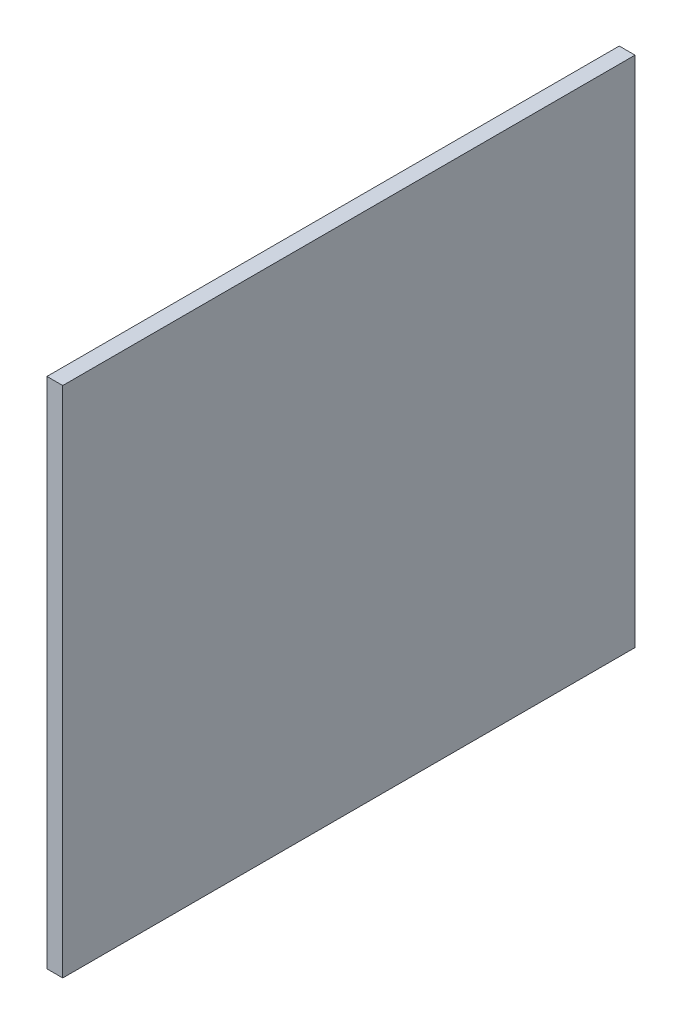
ISO-10303-21;
HEADER;
FILE_DESCRIPTION(('STEP AP214'),'2;1');
FILE_NAME('part.step','',(''),(''),'','','');
FILE_SCHEMA(('AUTOMOTIVE_DESIGN { 1 0 10303 214 1 1 1 1 }'));
ENDSEC;
DATA;
#1=APPLICATION_CONTEXT('core data for automotive mechanical design processes');
#2=APPLICATION_PROTOCOL_DEFINITION('international standard','automotive_design',2000,#1);
#3=PRODUCT_CONTEXT('',#1,'mechanical');
#4=PRODUCT('Part','Part','',(#3));
#5=PRODUCT_RELATED_PRODUCT_CATEGORY('part','',(#4));
#6=PRODUCT_DEFINITION_FORMATION('','',#4);
#7=PRODUCT_DEFINITION_CONTEXT('part definition',#1,'design');
#8=PRODUCT_DEFINITION('design','',#6,#7);
#9=PRODUCT_DEFINITION_SHAPE('','',#8);
#10=(LENGTH_UNIT() NAMED_UNIT(*) SI_UNIT(.MILLI.,.METRE.));
#11=(NAMED_UNIT(*) PLANE_ANGLE_UNIT() SI_UNIT($,.RADIAN.));
#12=(NAMED_UNIT(*) SI_UNIT($,.STERADIAN.) SOLID_ANGLE_UNIT());
#13=UNCERTAINTY_MEASURE_WITH_UNIT(LENGTH_MEASURE(1.E-05),#10,'distance_accuracy_value','');
#14=(GEOMETRIC_REPRESENTATION_CONTEXT(3) GLOBAL_UNCERTAINTY_ASSIGNED_CONTEXT((#13)) GLOBAL_UNIT_ASSIGNED_CONTEXT((#10,
#11,#12)) REPRESENTATION_CONTEXT('',''));
#15=CARTESIAN_POINT('',(0.,0.,0.));
#16=DIRECTION('',(0.,0.,1.));
#17=DIRECTION('',(1.,0.,0.));
#18=AXIS2_PLACEMENT_3D('',#15,#16,#17);
#19=CARTESIAN_POINT('',(-20.439998,-21.1500000000002,86.995008));
#20=DIRECTION('',(-1.,0.,0.));
#21=DIRECTION('',(0.,0.,1.));
#22=AXIS2_PLACEMENT_3D('',#19,#20,#21);
#23=PLANE('',#22);
#24=DIRECTION('',(0.,1.,0.));
#25=VECTOR('',#24,1.);
#26=CARTESIAN_POINT('',(-20.439998,-21.1500000000002,115.995008));
#27=LINE('',#26,#25);
#28=CARTESIAN_POINT('',(-20.439998,-21.1500000000002,115.995008));
#29=VERTEX_POINT('',#28);
#30=CARTESIAN_POINT('',(-20.439998,4.84999999999987,115.995008));
#31=VERTEX_POINT('',#30);
#32=EDGE_CURVE('E11',#29,#31,#27,.T.);
#33=ORIENTED_EDGE('',*,*,#32,.T.);
#34=DIRECTION('',(0.,0.,-1.));
#35=VECTOR('',#34,1.);
#36=CARTESIAN_POINT('',(-20.439998,4.84999999999987,86.995008));
#37=LINE('',#36,#35);
#38=CARTESIAN_POINT('',(-20.439998,4.84999999999987,86.995008));
#39=VERTEX_POINT('',#38);
#40=EDGE_CURVE('E27',#31,#39,#37,.T.);
#41=ORIENTED_EDGE('',*,*,#40,.T.);
#42=DIRECTION('',(0.,-1.,0.));
#43=VECTOR('',#42,1.);
#44=CARTESIAN_POINT('',(-20.439998,-21.1500000000002,86.995008));
#45=LINE('',#44,#43);
#46=CARTESIAN_POINT('',(-20.439998,-21.1500000000002,86.995008));
#47=VERTEX_POINT('',#46);
#48=EDGE_CURVE('E79',#39,#47,#45,.T.);
#49=ORIENTED_EDGE('',*,*,#48,.T.);
#50=DIRECTION('',(0.,0.,1.));
#51=VECTOR('',#50,1.);
#52=CARTESIAN_POINT('',(-20.439998,-21.1500000000002,86.995008));
#53=LINE('',#52,#51);
#54=EDGE_CURVE('E81',#47,#29,#53,.T.);
#55=ORIENTED_EDGE('',*,*,#54,.T.);
#56=EDGE_LOOP('',(#33,#41,#49,#55));
#57=FACE_BOUND('',#56,.T.);
#58=ADVANCED_FACE('F17',(#57),#23,.T.);
#59=CARTESIAN_POINT('',(-20.439998,4.84999999999987,115.995008));
#60=DIRECTION('',(0.,1.,0.));
#61=DIRECTION('',(0.,0.,1.));
#62=AXIS2_PLACEMENT_3D('',#59,#60,#61);
#63=PLANE('',#62);
#64=DIRECTION('',(1.,0.,0.));
#65=VECTOR('',#64,1.);
#66=CARTESIAN_POINT('',(-20.439998,4.84999999999987,86.995008));
#67=LINE('',#66,#65);
#68=CARTESIAN_POINT('',(-19.639998,4.84999999999987,86.995008));
#69=VERTEX_POINT('',#68);
#70=EDGE_CURVE('E76',#39,#69,#67,.T.);
#71=ORIENTED_EDGE('',*,*,#70,.F.);
#72=ORIENTED_EDGE('',*,*,#40,.F.);
#73=DIRECTION('',(-1.,0.,0.));
#74=VECTOR('',#73,1.);
#75=CARTESIAN_POINT('',(-20.439998,4.84999999999987,115.995008));
#76=LINE('',#75,#74);
#77=CARTESIAN_POINT('',(-19.639998,4.84999999999987,115.995008));
#78=VERTEX_POINT('',#77);
#79=EDGE_CURVE('E35',#78,#31,#76,.T.);
#80=ORIENTED_EDGE('',*,*,#79,.F.);
#81=DIRECTION('',(0.,0.,1.));
#82=VECTOR('',#81,1.);
#83=CARTESIAN_POINT('',(-19.639998,4.84999999999987,115.995008));
#84=LINE('',#83,#82);
#85=EDGE_CURVE('E59',#69,#78,#84,.T.);
#86=ORIENTED_EDGE('',*,*,#85,.F.);
#87=EDGE_LOOP('',(#71,#72,#80,#86));
#88=FACE_BOUND('',#87,.T.);
#89=ADVANCED_FACE('F91',(#88),#63,.T.);
#90=CARTESIAN_POINT('',(-20.439998,-21.1500000000002,115.995008));
#91=DIRECTION('',(0.,0.,1.));
#92=DIRECTION('',(1.,0.,0.));
#93=AXIS2_PLACEMENT_3D('',#90,#91,#92);
#94=PLANE('',#93);
#95=ORIENTED_EDGE('',*,*,#79,.T.);
#96=ORIENTED_EDGE('',*,*,#32,.F.);
#97=DIRECTION('',(-1.,0.,0.));
#98=VECTOR('',#97,1.);
#99=CARTESIAN_POINT('',(-20.439998,-21.1500000000002,115.995008));
#100=LINE('',#99,#98);
#101=CARTESIAN_POINT('',(-19.639998,-21.1500000000002,115.995008));
#102=VERTEX_POINT('',#101);
#103=EDGE_CURVE('E62',#102,#29,#100,.T.);
#104=ORIENTED_EDGE('',*,*,#103,.F.);
#105=DIRECTION('',(0.,-1.,0.));
#106=VECTOR('',#105,1.);
#107=CARTESIAN_POINT('',(-19.639998,-21.1500000000002,115.995008));
#108=LINE('',#107,#106);
#109=EDGE_CURVE('E55',#78,#102,#108,.T.);
#110=ORIENTED_EDGE('',*,*,#109,.F.);
#111=EDGE_LOOP('',(#95,#96,#104,#110));
#112=FACE_BOUND('',#111,.T.);
#113=ADVANCED_FACE('F63',(#112),#94,.T.);
#114=CARTESIAN_POINT('',(-20.439998,-21.1500000000002,86.995008));
#115=DIRECTION('',(0.,-1.,0.));
#116=DIRECTION('',(0.,0.,-1.));
#117=AXIS2_PLACEMENT_3D('',#114,#115,#116);
#118=PLANE('',#117);
#119=ORIENTED_EDGE('',*,*,#103,.T.);
#120=ORIENTED_EDGE('',*,*,#54,.F.);
#121=DIRECTION('',(-1.,0.,0.));
#122=VECTOR('',#121,1.);
#123=CARTESIAN_POINT('',(-20.439998,-21.1500000000002,86.995008));
#124=LINE('',#123,#122);
#125=CARTESIAN_POINT('',(-19.639998,-21.1500000000002,86.995008));
#126=VERTEX_POINT('',#125);
#127=EDGE_CURVE('E67',#126,#47,#124,.T.);
#128=ORIENTED_EDGE('',*,*,#127,.F.);
#129=DIRECTION('',(0.,0.,-1.));
#130=VECTOR('',#129,1.);
#131=CARTESIAN_POINT('',(-19.639998,-21.1500000000002,86.995008));
#132=LINE('',#131,#130);
#133=EDGE_CURVE('E21',#102,#126,#132,.T.);
#134=ORIENTED_EDGE('',*,*,#133,.F.);
#135=EDGE_LOOP('',(#119,#120,#128,#134));
#136=FACE_BOUND('',#135,.T.);
#137=ADVANCED_FACE('F70',(#136),#118,.T.);
#138=CARTESIAN_POINT('',(-20.439998,4.84999999999987,86.995008));
#139=DIRECTION('',(0.,0.,-1.));
#140=DIRECTION('',(-1.,0.,0.));
#141=AXIS2_PLACEMENT_3D('',#138,#139,#140);
#142=PLANE('',#141);
#143=ORIENTED_EDGE('',*,*,#127,.T.);
#144=ORIENTED_EDGE('',*,*,#48,.F.);
#145=ORIENTED_EDGE('',*,*,#70,.T.);
#146=DIRECTION('',(0.,1.,0.));
#147=VECTOR('',#146,1.);
#148=CARTESIAN_POINT('',(-19.639998,4.84999999999987,86.995008));
#149=LINE('',#148,#147);
#150=EDGE_CURVE('E71',#126,#69,#149,.T.);
#151=ORIENTED_EDGE('',*,*,#150,.F.);
#152=EDGE_LOOP('',(#143,#144,#145,#151));
#153=FACE_BOUND('',#152,.T.);
#154=ADVANCED_FACE('F89',(#153),#142,.T.);
#155=CARTESIAN_POINT('',(-19.639998,-21.1500000000002,86.995008));
#156=DIRECTION('',(1.,0.,0.));
#157=DIRECTION('',(0.,0.,-1.));
#158=AXIS2_PLACEMENT_3D('',#155,#156,#157);
#159=PLANE('',#158);
#160=ORIENTED_EDGE('',*,*,#85,.T.);
#161=ORIENTED_EDGE('',*,*,#109,.T.);
#162=ORIENTED_EDGE('',*,*,#133,.T.);
#163=ORIENTED_EDGE('',*,*,#150,.T.);
#164=EDGE_LOOP('',(#160,#161,#162,#163));
#165=FACE_BOUND('',#164,.T.);
#166=ADVANCED_FACE('F19',(#165),#159,.T.);
#167=CLOSED_SHELL('',(#58,#89,#113,#137,#154,#166));
#168=MANIFOLD_SOLID_BREP('B1',#167);
#169=ADVANCED_BREP_SHAPE_REPRESENTATION('',(#18,#168),#14);
#170=SHAPE_DEFINITION_REPRESENTATION(#9,#169);
ENDSEC;
END-ISO-10303-21;
